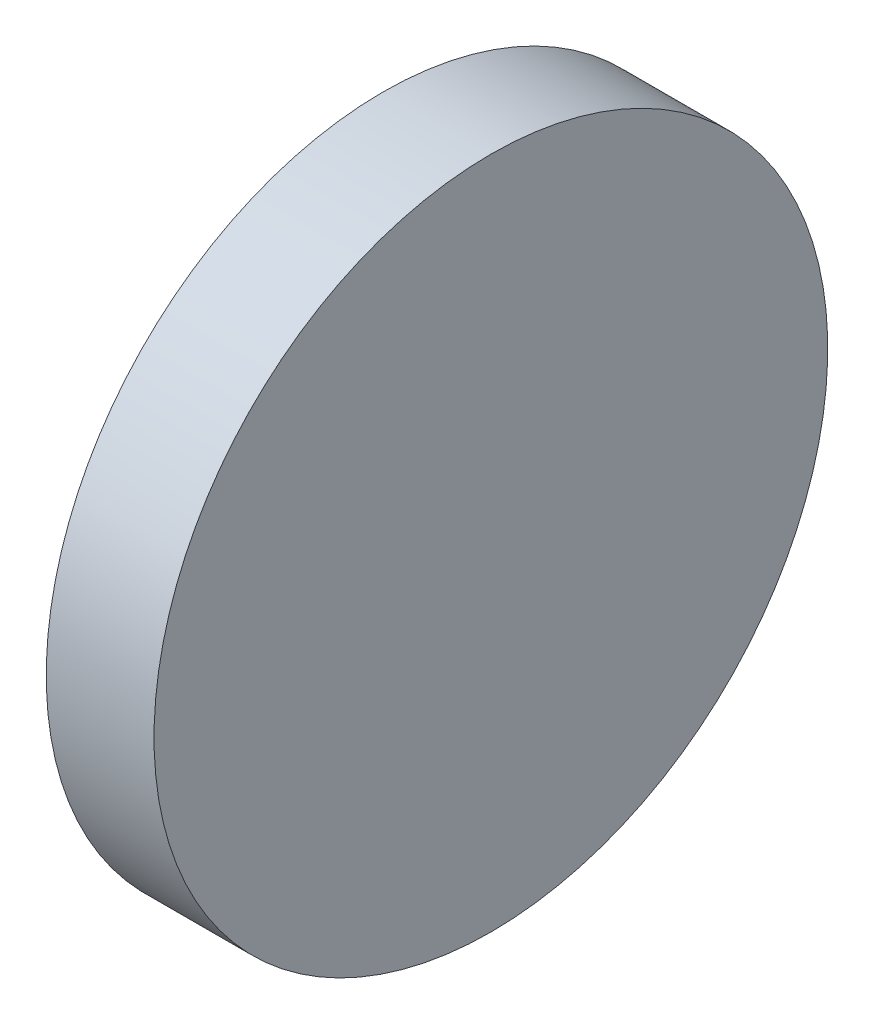
ISO-10303-21;
HEADER;
FILE_DESCRIPTION(('STEP AP214'),'2;1');
FILE_NAME('part.step','',(''),(''),'','','');
FILE_SCHEMA(('AUTOMOTIVE_DESIGN { 1 0 10303 214 1 1 1 1 }'));
ENDSEC;
DATA;
#1=APPLICATION_CONTEXT('core data for automotive mechanical design processes');
#2=APPLICATION_PROTOCOL_DEFINITION('international standard','automotive_design',2000,#1);
#3=PRODUCT_CONTEXT('',#1,'mechanical');
#4=PRODUCT('Part','Part','',(#3));
#5=PRODUCT_RELATED_PRODUCT_CATEGORY('part','',(#4));
#6=PRODUCT_DEFINITION_FORMATION('','',#4);
#7=PRODUCT_DEFINITION_CONTEXT('part definition',#1,'design');
#8=PRODUCT_DEFINITION('design','',#6,#7);
#9=PRODUCT_DEFINITION_SHAPE('','',#8);
#10=(LENGTH_UNIT() NAMED_UNIT(*) SI_UNIT(.MILLI.,.METRE.));
#11=(NAMED_UNIT(*) PLANE_ANGLE_UNIT() SI_UNIT($,.RADIAN.));
#12=(NAMED_UNIT(*) SI_UNIT($,.STERADIAN.) SOLID_ANGLE_UNIT());
#13=UNCERTAINTY_MEASURE_WITH_UNIT(LENGTH_MEASURE(1.E-05),#10,'distance_accuracy_value','');
#14=(GEOMETRIC_REPRESENTATION_CONTEXT(3) GLOBAL_UNCERTAINTY_ASSIGNED_CONTEXT((#13)) GLOBAL_UNIT_ASSIGNED_CONTEXT((#10,
#11,#12)) REPRESENTATION_CONTEXT('',''));
#15=CARTESIAN_POINT('',(0.,0.,0.));
#16=DIRECTION('',(0.,0.,1.));
#17=DIRECTION('',(1.,0.,0.));
#18=AXIS2_PLACEMENT_3D('',#15,#16,#17);
#19=CARTESIAN_POINT('',(-0.965364285309383,-0.332340218761648,0.1012));
#20=DIRECTION('',(-1.,0.,0.));
#21=DIRECTION('',(0.,-1.,0.));
#22=AXIS2_PLACEMENT_3D('',#19,#20,#21);
#23=PLANE('',#22);
#24=CARTESIAN_POINT('',(-0.965364285309383,-0.332340218761648,0.1012));
#25=DIRECTION('',(1.,0.,0.));
#26=DIRECTION('',(0.,1.,0.));
#27=AXIS2_PLACEMENT_3D('',#24,#25,#26);
#28=CIRCLE('',#27,0.03125);
#29=CARTESIAN_POINT('',(-0.965364285309383,-0.301090218761648,0.1012));
#30=VERTEX_POINT('',#29);
#31=EDGE_CURVE('E18',#30,#30,#28,.F.);
#32=ORIENTED_EDGE('',*,*,#31,.F.);
#33=EDGE_LOOP('',(#32));
#34=FACE_BOUND('',#33,.T.);
#35=ADVANCED_FACE('F15',(#34),#23,.F.);
#36=CARTESIAN_POINT('',(-0.945364285309383,-0.332340218761648,0.1012));
#37=DIRECTION('',(1.,0.,0.));
#38=DIRECTION('',(0.,1.,0.));
#39=AXIS2_PLACEMENT_3D('',#36,#37,#38);
#40=CYLINDRICAL_SURFACE('',#39,0.03125);
#41=CARTESIAN_POINT('',(-0.975364285309383,-0.332340218761648,0.1012));
#42=DIRECTION('',(1.,0.,0.));
#43=DIRECTION('',(0.,1.,0.));
#44=AXIS2_PLACEMENT_3D('',#41,#42,#43);
#45=CIRCLE('',#44,0.03125);
#46=CARTESIAN_POINT('',(-0.975364285309383,-0.301090218761648,0.1012));
#47=VERTEX_POINT('',#46);
#48=EDGE_CURVE('E10',#47,#47,#45,.T.);
#49=ORIENTED_EDGE('',*,*,#48,.T.);
#50=EDGE_LOOP('',(#49));
#51=FACE_BOUND('',#50,.T.);
#52=ORIENTED_EDGE('',*,*,#31,.T.);
#53=EDGE_LOOP('',(#52));
#54=FACE_BOUND('',#53,.T.);
#55=ADVANCED_FACE('F27',(#51,#54),#40,.T.);
#56=CARTESIAN_POINT('',(-0.975364285309383,-0.332340218761648,0.1012));
#57=DIRECTION('',(1.,0.,0.));
#58=DIRECTION('',(0.,1.,0.));
#59=AXIS2_PLACEMENT_3D('',#56,#57,#58);
#60=PLANE('',#59);
#61=ORIENTED_EDGE('',*,*,#48,.F.);
#62=EDGE_LOOP('',(#61));
#63=FACE_BOUND('',#62,.T.);
#64=ADVANCED_FACE('F34',(#63),#60,.F.);
#65=CLOSED_SHELL('',(#35,#55,#64));
#66=MANIFOLD_SOLID_BREP('B1',#65);
#67=ADVANCED_BREP_SHAPE_REPRESENTATION('',(#18,#66),#14);
#68=SHAPE_DEFINITION_REPRESENTATION(#9,#67);
ENDSEC;
END-ISO-10303-21;
